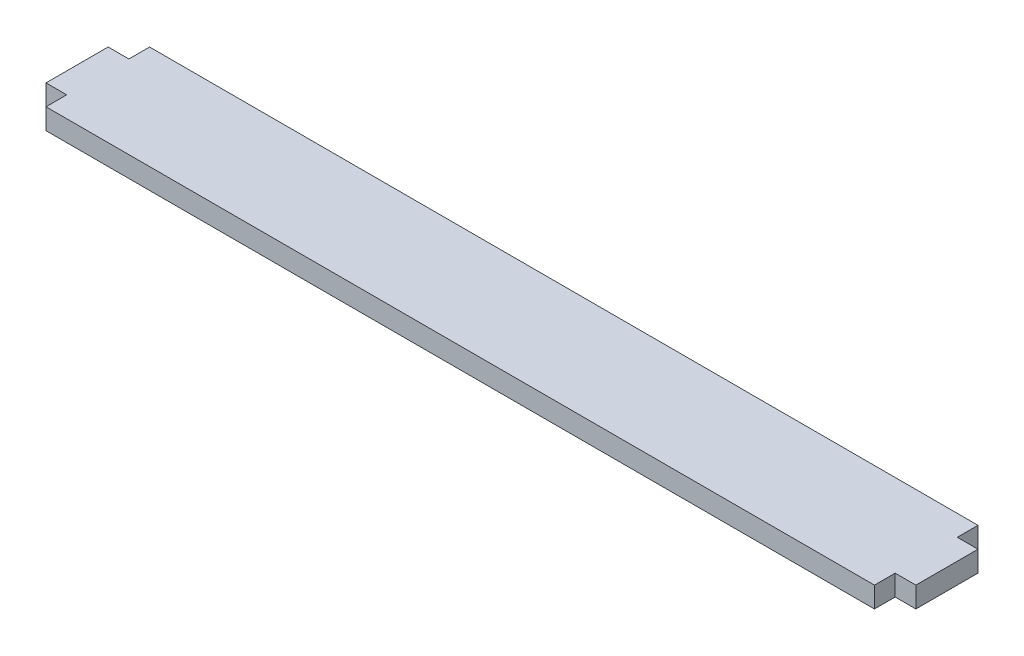
ISO-10303-21;
HEADER;
FILE_DESCRIPTION(('STEP AP214'),'2;1');
FILE_NAME('part.step','',(''),(''),'','','');
FILE_SCHEMA(('AUTOMOTIVE_DESIGN { 1 0 10303 214 1 1 1 1 }'));
ENDSEC;
DATA;
#1=APPLICATION_CONTEXT('core data for automotive mechanical design processes');
#2=APPLICATION_PROTOCOL_DEFINITION('international standard','automotive_design',2000,#1);
#3=PRODUCT_CONTEXT('',#1,'mechanical');
#4=PRODUCT('Part','Part','',(#3));
#5=PRODUCT_RELATED_PRODUCT_CATEGORY('part','',(#4));
#6=PRODUCT_DEFINITION_FORMATION('','',#4);
#7=PRODUCT_DEFINITION_CONTEXT('part definition',#1,'design');
#8=PRODUCT_DEFINITION('design','',#6,#7);
#9=PRODUCT_DEFINITION_SHAPE('','',#8);
#10=(LENGTH_UNIT() NAMED_UNIT(*) SI_UNIT(.MILLI.,.METRE.));
#11=(NAMED_UNIT(*) PLANE_ANGLE_UNIT() SI_UNIT($,.RADIAN.));
#12=(NAMED_UNIT(*) SI_UNIT($,.STERADIAN.) SOLID_ANGLE_UNIT());
#13=UNCERTAINTY_MEASURE_WITH_UNIT(LENGTH_MEASURE(1.E-05),#10,'distance_accuracy_value','');
#14=(GEOMETRIC_REPRESENTATION_CONTEXT(3) GLOBAL_UNCERTAINTY_ASSIGNED_CONTEXT((#13)) GLOBAL_UNIT_ASSIGNED_CONTEXT((#10,
#11,#12)) REPRESENTATION_CONTEXT('',''));
#15=CARTESIAN_POINT('',(0.,0.,0.));
#16=DIRECTION('',(0.,0.,1.));
#17=DIRECTION('',(1.,0.,0.));
#18=AXIS2_PLACEMENT_3D('',#15,#16,#17);
#19=CARTESIAN_POINT('',(-63.5,3.175,4.7625));
#20=DIRECTION('',(1.,0.,0.));
#21=DIRECTION('',(0.,0.,-1.));
#22=AXIS2_PLACEMENT_3D('',#19,#20,#21);
#23=PLANE('',#22);
#24=DIRECTION('',(0.,0.,1.));
#25=VECTOR('',#24,1.);
#26=CARTESIAN_POINT('',(-63.5,0.,4.7625));
#27=LINE('',#26,#25);
#28=CARTESIAN_POINT('',(-63.5,0.,4.7625));
#29=VERTEX_POINT('',#28);
#30=CARTESIAN_POINT('',(-63.5,0.,7.9375));
#31=VERTEX_POINT('',#30);
#32=EDGE_CURVE('E159',#29,#31,#27,.T.);
#33=ORIENTED_EDGE('',*,*,#32,.T.);
#34=DIRECTION('',(0.,-1.,0.));
#35=VECTOR('',#34,1.);
#36=CARTESIAN_POINT('',(-63.5,3.175,7.9375));
#37=LINE('',#36,#35);
#38=CARTESIAN_POINT('',(-63.5,3.175,7.9375));
#39=VERTEX_POINT('',#38);
#40=EDGE_CURVE('E11',#39,#31,#37,.T.);
#41=ORIENTED_EDGE('',*,*,#40,.F.);
#42=DIRECTION('',(0.,0.,1.));
#43=VECTOR('',#42,1.);
#44=CARTESIAN_POINT('',(-63.5,3.175,4.7625));
#45=LINE('',#44,#43);
#46=CARTESIAN_POINT('',(-63.5,3.175,4.7625));
#47=VERTEX_POINT('',#46);
#48=EDGE_CURVE('E181',#47,#39,#45,.T.);
#49=ORIENTED_EDGE('',*,*,#48,.F.);
#50=DIRECTION('',(0.,-1.,0.));
#51=VECTOR('',#50,1.);
#52=CARTESIAN_POINT('',(-63.5,3.175,4.7625));
#53=LINE('',#52,#51);
#54=EDGE_CURVE('E155',#47,#29,#53,.T.);
#55=ORIENTED_EDGE('',*,*,#54,.T.);
#56=EDGE_LOOP('',(#33,#41,#49,#55));
#57=FACE_BOUND('',#56,.T.);
#58=ADVANCED_FACE('F39',(#57),#23,.F.);
#59=CARTESIAN_POINT('',(-63.5,3.175,7.9375));
#60=DIRECTION('',(0.,0.,-1.));
#61=DIRECTION('',(-1.,0.,0.));
#62=AXIS2_PLACEMENT_3D('',#59,#60,#61);
#63=PLANE('',#62);
#64=DIRECTION('',(1.,0.,0.));
#65=VECTOR('',#64,1.);
#66=CARTESIAN_POINT('',(-63.5,0.,7.9375));
#67=LINE('',#66,#65);
#68=CARTESIAN_POINT('',(63.5,0.,7.9375));
#69=VERTEX_POINT('',#68);
#70=EDGE_CURVE('E162',#31,#69,#67,.T.);
#71=ORIENTED_EDGE('',*,*,#70,.T.);
#72=DIRECTION('',(0.,-1.,0.));
#73=VECTOR('',#72,1.);
#74=CARTESIAN_POINT('',(63.5,3.175,7.9375));
#75=LINE('',#74,#73);
#76=CARTESIAN_POINT('',(63.5,3.175,7.9375));
#77=VERTEX_POINT('',#76);
#78=EDGE_CURVE('E47',#77,#69,#75,.T.);
#79=ORIENTED_EDGE('',*,*,#78,.F.);
#80=DIRECTION('',(1.,0.,0.));
#81=VECTOR('',#80,1.);
#82=CARTESIAN_POINT('',(-63.5,3.175,7.9375));
#83=LINE('',#82,#81);
#84=EDGE_CURVE('E110',#39,#77,#83,.T.);
#85=ORIENTED_EDGE('',*,*,#84,.F.);
#86=ORIENTED_EDGE('',*,*,#40,.T.);
#87=EDGE_LOOP('',(#71,#79,#85,#86));
#88=FACE_BOUND('',#87,.T.);
#89=ADVANCED_FACE('F259',(#88),#63,.F.);
#90=CARTESIAN_POINT('',(63.5,3.175,7.9375));
#91=DIRECTION('',(-1.,0.,0.));
#92=DIRECTION('',(0.,0.,1.));
#93=AXIS2_PLACEMENT_3D('',#90,#91,#92);
#94=PLANE('',#93);
#95=DIRECTION('',(0.,0.,-1.));
#96=VECTOR('',#95,1.);
#97=CARTESIAN_POINT('',(63.5,0.,7.9375));
#98=LINE('',#97,#96);
#99=CARTESIAN_POINT('',(63.5,0.,4.7625));
#100=VERTEX_POINT('',#99);
#101=EDGE_CURVE('E164',#69,#100,#98,.T.);
#102=ORIENTED_EDGE('',*,*,#101,.T.);
#103=DIRECTION('',(0.,-1.,0.));
#104=VECTOR('',#103,1.);
#105=CARTESIAN_POINT('',(63.5,3.175,4.7625));
#106=LINE('',#105,#104);
#107=CARTESIAN_POINT('',(63.5,3.175,4.7625));
#108=VERTEX_POINT('',#107);
#109=EDGE_CURVE('E200',#108,#100,#106,.T.);
#110=ORIENTED_EDGE('',*,*,#109,.F.);
#111=DIRECTION('',(0.,0.,-1.));
#112=VECTOR('',#111,1.);
#113=CARTESIAN_POINT('',(63.5,3.175,7.9375));
#114=LINE('',#113,#112);
#115=EDGE_CURVE('E208',#77,#108,#114,.T.);
#116=ORIENTED_EDGE('',*,*,#115,.F.);
#117=ORIENTED_EDGE('',*,*,#78,.T.);
#118=EDGE_LOOP('',(#102,#110,#116,#117));
#119=FACE_BOUND('',#118,.T.);
#120=ADVANCED_FACE('F206',(#119),#94,.F.);
#121=CARTESIAN_POINT('',(63.5,3.175,4.7625));
#122=DIRECTION('',(0.,0.,-1.));
#123=DIRECTION('',(-1.,0.,0.));
#124=AXIS2_PLACEMENT_3D('',#121,#122,#123);
#125=PLANE('',#124);
#126=DIRECTION('',(1.,0.,0.));
#127=VECTOR('',#126,1.);
#128=CARTESIAN_POINT('',(63.5,0.,4.7625));
#129=LINE('',#128,#127);
#130=CARTESIAN_POINT('',(66.675,0.,4.7625));
#131=VERTEX_POINT('',#130);
#132=EDGE_CURVE('E166',#100,#131,#129,.T.);
#133=ORIENTED_EDGE('',*,*,#132,.T.);
#134=DIRECTION('',(0.,-1.,0.));
#135=VECTOR('',#134,1.);
#136=CARTESIAN_POINT('',(66.675,3.175,4.7625));
#137=LINE('',#136,#135);
#138=CARTESIAN_POINT('',(66.675,3.175,4.7625));
#139=VERTEX_POINT('',#138);
#140=EDGE_CURVE('E197',#139,#131,#137,.T.);
#141=ORIENTED_EDGE('',*,*,#140,.F.);
#142=DIRECTION('',(1.,0.,0.));
#143=VECTOR('',#142,1.);
#144=CARTESIAN_POINT('',(63.5,3.175,4.7625));
#145=LINE('',#144,#143);
#146=EDGE_CURVE('E226',#108,#139,#145,.T.);
#147=ORIENTED_EDGE('',*,*,#146,.F.);
#148=ORIENTED_EDGE('',*,*,#109,.T.);
#149=EDGE_LOOP('',(#133,#141,#147,#148));
#150=FACE_BOUND('',#149,.T.);
#151=ADVANCED_FACE('F217',(#150),#125,.F.);
#152=CARTESIAN_POINT('',(66.675,3.175,4.7625));
#153=DIRECTION('',(-1.,0.,0.));
#154=DIRECTION('',(0.,0.,1.));
#155=AXIS2_PLACEMENT_3D('',#152,#153,#154);
#156=PLANE('',#155);
#157=DIRECTION('',(0.,0.,-1.));
#158=VECTOR('',#157,1.);
#159=CARTESIAN_POINT('',(66.675,0.,4.7625));
#160=LINE('',#159,#158);
#161=CARTESIAN_POINT('',(66.675,0.,-4.7625));
#162=VERTEX_POINT('',#161);
#163=EDGE_CURVE('E168',#131,#162,#160,.T.);
#164=ORIENTED_EDGE('',*,*,#163,.T.);
#165=DIRECTION('',(0.,-1.,0.));
#166=VECTOR('',#165,1.);
#167=CARTESIAN_POINT('',(66.675,3.175,-4.7625));
#168=LINE('',#167,#166);
#169=CARTESIAN_POINT('',(66.675,3.175,-4.7625));
#170=VERTEX_POINT('',#169);
#171=EDGE_CURVE('E194',#170,#162,#168,.T.);
#172=ORIENTED_EDGE('',*,*,#171,.F.);
#173=DIRECTION('',(0.,0.,-1.));
#174=VECTOR('',#173,1.);
#175=CARTESIAN_POINT('',(66.675,3.175,4.7625));
#176=LINE('',#175,#174);
#177=EDGE_CURVE('E223',#139,#170,#176,.T.);
#178=ORIENTED_EDGE('',*,*,#177,.F.);
#179=ORIENTED_EDGE('',*,*,#140,.T.);
#180=EDGE_LOOP('',(#164,#172,#178,#179));
#181=FACE_BOUND('',#180,.T.);
#182=ADVANCED_FACE('F221',(#181),#156,.F.);
#183=CARTESIAN_POINT('',(66.675,3.175,-4.7625));
#184=DIRECTION('',(0.,0.,1.));
#185=DIRECTION('',(1.,0.,0.));
#186=AXIS2_PLACEMENT_3D('',#183,#184,#185);
#187=PLANE('',#186);
#188=DIRECTION('',(-1.,0.,0.));
#189=VECTOR('',#188,1.);
#190=CARTESIAN_POINT('',(66.675,0.,-4.7625));
#191=LINE('',#190,#189);
#192=CARTESIAN_POINT('',(63.5,0.,-4.7625));
#193=VERTEX_POINT('',#192);
#194=EDGE_CURVE('E170',#162,#193,#191,.T.);
#195=ORIENTED_EDGE('',*,*,#194,.T.);
#196=DIRECTION('',(0.,-1.,0.));
#197=VECTOR('',#196,1.);
#198=CARTESIAN_POINT('',(63.5,3.175,-4.7625));
#199=LINE('',#198,#197);
#200=CARTESIAN_POINT('',(63.5,3.175,-4.7625));
#201=VERTEX_POINT('',#200);
#202=EDGE_CURVE('E191',#201,#193,#199,.T.);
#203=ORIENTED_EDGE('',*,*,#202,.F.);
#204=DIRECTION('',(-1.,0.,0.));
#205=VECTOR('',#204,1.);
#206=CARTESIAN_POINT('',(66.675,3.175,-4.7625));
#207=LINE('',#206,#205);
#208=EDGE_CURVE('E225',#170,#201,#207,.T.);
#209=ORIENTED_EDGE('',*,*,#208,.F.);
#210=ORIENTED_EDGE('',*,*,#171,.T.);
#211=EDGE_LOOP('',(#195,#203,#209,#210));
#212=FACE_BOUND('',#211,.T.);
#213=ADVANCED_FACE('F272',(#212),#187,.F.);
#214=CARTESIAN_POINT('',(63.5,3.175,-4.7625));
#215=DIRECTION('',(-1.,0.,0.));
#216=DIRECTION('',(0.,0.,1.));
#217=AXIS2_PLACEMENT_3D('',#214,#215,#216);
#218=PLANE('',#217);
#219=DIRECTION('',(0.,0.,-1.));
#220=VECTOR('',#219,1.);
#221=CARTESIAN_POINT('',(63.5,0.,-4.7625));
#222=LINE('',#221,#220);
#223=CARTESIAN_POINT('',(63.5,0.,-7.9375));
#224=VERTEX_POINT('',#223);
#225=EDGE_CURVE('E172',#193,#224,#222,.T.);
#226=ORIENTED_EDGE('',*,*,#225,.T.);
#227=DIRECTION('',(0.,-1.,0.));
#228=VECTOR('',#227,1.);
#229=CARTESIAN_POINT('',(63.5,3.175,-7.9375));
#230=LINE('',#229,#228);
#231=CARTESIAN_POINT('',(63.5,3.175,-7.9375));
#232=VERTEX_POINT('',#231);
#233=EDGE_CURVE('E188',#232,#224,#230,.T.);
#234=ORIENTED_EDGE('',*,*,#233,.F.);
#235=DIRECTION('',(0.,0.,-1.));
#236=VECTOR('',#235,1.);
#237=CARTESIAN_POINT('',(63.5,3.175,-4.7625));
#238=LINE('',#237,#236);
#239=EDGE_CURVE('E228',#201,#232,#238,.T.);
#240=ORIENTED_EDGE('',*,*,#239,.F.);
#241=ORIENTED_EDGE('',*,*,#202,.T.);
#242=EDGE_LOOP('',(#226,#234,#240,#241));
#243=FACE_BOUND('',#242,.T.);
#244=ADVANCED_FACE('F275',(#243),#218,.F.);
#245=CARTESIAN_POINT('',(63.5,3.175,-7.9375));
#246=DIRECTION('',(0.,0.,1.));
#247=DIRECTION('',(1.,0.,0.));
#248=AXIS2_PLACEMENT_3D('',#245,#246,#247);
#249=PLANE('',#248);
#250=DIRECTION('',(-1.,0.,0.));
#251=VECTOR('',#250,1.);
#252=CARTESIAN_POINT('',(63.5,0.,-7.9375));
#253=LINE('',#252,#251);
#254=CARTESIAN_POINT('',(-63.5,0.,-7.9375));
#255=VERTEX_POINT('',#254);
#256=EDGE_CURVE('E174',#224,#255,#253,.T.);
#257=ORIENTED_EDGE('',*,*,#256,.T.);
#258=DIRECTION('',(0.,-1.,0.));
#259=VECTOR('',#258,1.);
#260=CARTESIAN_POINT('',(-63.5,3.175,-7.9375));
#261=LINE('',#260,#259);
#262=CARTESIAN_POINT('',(-63.5,3.175,-7.9375));
#263=VERTEX_POINT('',#262);
#264=EDGE_CURVE('E185',#263,#255,#261,.T.);
#265=ORIENTED_EDGE('',*,*,#264,.F.);
#266=DIRECTION('',(-1.,0.,0.));
#267=VECTOR('',#266,1.);
#268=CARTESIAN_POINT('',(63.5,3.175,-7.9375));
#269=LINE('',#268,#267);
#270=EDGE_CURVE('E234',#232,#263,#269,.T.);
#271=ORIENTED_EDGE('',*,*,#270,.F.);
#272=ORIENTED_EDGE('',*,*,#233,.T.);
#273=EDGE_LOOP('',(#257,#265,#271,#272));
#274=FACE_BOUND('',#273,.T.);
#275=ADVANCED_FACE('F240',(#274),#249,.F.);
#276=CARTESIAN_POINT('',(-63.5,3.175,-7.9375));
#277=DIRECTION('',(1.,0.,0.));
#278=DIRECTION('',(0.,0.,-1.));
#279=AXIS2_PLACEMENT_3D('',#276,#277,#278);
#280=PLANE('',#279);
#281=DIRECTION('',(0.,0.,1.));
#282=VECTOR('',#281,1.);
#283=CARTESIAN_POINT('',(-63.5,0.,-7.9375));
#284=LINE('',#283,#282);
#285=CARTESIAN_POINT('',(-63.5,0.,-4.7625));
#286=VERTEX_POINT('',#285);
#287=EDGE_CURVE('E176',#255,#286,#284,.T.);
#288=ORIENTED_EDGE('',*,*,#287,.T.);
#289=DIRECTION('',(0.,-1.,0.));
#290=VECTOR('',#289,1.);
#291=CARTESIAN_POINT('',(-63.5,3.175,-4.7625));
#292=LINE('',#291,#290);
#293=CARTESIAN_POINT('',(-63.5,3.175,-4.7625));
#294=VERTEX_POINT('',#293);
#295=EDGE_CURVE('E150',#294,#286,#292,.T.);
#296=ORIENTED_EDGE('',*,*,#295,.F.);
#297=DIRECTION('',(0.,0.,1.));
#298=VECTOR('',#297,1.);
#299=CARTESIAN_POINT('',(-63.5,3.175,-7.9375));
#300=LINE('',#299,#298);
#301=EDGE_CURVE('E141',#263,#294,#300,.T.);
#302=ORIENTED_EDGE('',*,*,#301,.F.);
#303=ORIENTED_EDGE('',*,*,#264,.T.);
#304=EDGE_LOOP('',(#288,#296,#302,#303));
#305=FACE_BOUND('',#304,.T.);
#306=ADVANCED_FACE('F244',(#305),#280,.F.);
#307=CARTESIAN_POINT('',(-63.5,3.175,-4.7625));
#308=DIRECTION('',(0.,0.,1.));
#309=DIRECTION('',(1.,0.,0.));
#310=AXIS2_PLACEMENT_3D('',#307,#308,#309);
#311=PLANE('',#310);
#312=DIRECTION('',(-1.,0.,0.));
#313=VECTOR('',#312,1.);
#314=CARTESIAN_POINT('',(-63.5,0.,-4.7625));
#315=LINE('',#314,#313);
#316=CARTESIAN_POINT('',(-66.675,0.,-4.7625));
#317=VERTEX_POINT('',#316);
#318=EDGE_CURVE('E149',#286,#317,#315,.T.);
#319=ORIENTED_EDGE('',*,*,#318,.T.);
#320=DIRECTION('',(0.,-1.,0.));
#321=VECTOR('',#320,1.);
#322=CARTESIAN_POINT('',(-66.675,3.175,-4.7625));
#323=LINE('',#322,#321);
#324=CARTESIAN_POINT('',(-66.675,3.175,-4.7625));
#325=VERTEX_POINT('',#324);
#326=EDGE_CURVE('E146',#325,#317,#323,.T.);
#327=ORIENTED_EDGE('',*,*,#326,.F.);
#328=DIRECTION('',(-1.,0.,0.));
#329=VECTOR('',#328,1.);
#330=CARTESIAN_POINT('',(-63.5,3.175,-4.7625));
#331=LINE('',#330,#329);
#332=EDGE_CURVE('E135',#294,#325,#331,.T.);
#333=ORIENTED_EDGE('',*,*,#332,.F.);
#334=ORIENTED_EDGE('',*,*,#295,.T.);
#335=EDGE_LOOP('',(#319,#327,#333,#334));
#336=FACE_BOUND('',#335,.T.);
#337=ADVANCED_FACE('F147',(#336),#311,.F.);
#338=CARTESIAN_POINT('',(-66.675,3.175,-4.7625));
#339=DIRECTION('',(1.,0.,0.));
#340=DIRECTION('',(0.,0.,-1.));
#341=AXIS2_PLACEMENT_3D('',#338,#339,#340);
#342=PLANE('',#341);
#343=DIRECTION('',(0.,0.,1.));
#344=VECTOR('',#343,1.);
#345=CARTESIAN_POINT('',(-66.675,0.,-4.7625));
#346=LINE('',#345,#344);
#347=CARTESIAN_POINT('',(-66.675,0.,4.7625));
#348=VERTEX_POINT('',#347);
#349=EDGE_CURVE('E96',#317,#348,#346,.T.);
#350=ORIENTED_EDGE('',*,*,#349,.T.);
#351=DIRECTION('',(0.,-1.,0.));
#352=VECTOR('',#351,1.);
#353=CARTESIAN_POINT('',(-66.675,3.175,4.7625));
#354=LINE('',#353,#352);
#355=CARTESIAN_POINT('',(-66.675,3.175,4.7625));
#356=VERTEX_POINT('',#355);
#357=EDGE_CURVE('E151',#356,#348,#354,.T.);
#358=ORIENTED_EDGE('',*,*,#357,.F.);
#359=DIRECTION('',(0.,0.,1.));
#360=VECTOR('',#359,1.);
#361=CARTESIAN_POINT('',(-66.675,3.175,-4.7625));
#362=LINE('',#361,#360);
#363=EDGE_CURVE('E139',#325,#356,#362,.T.);
#364=ORIENTED_EDGE('',*,*,#363,.F.);
#365=ORIENTED_EDGE('',*,*,#326,.T.);
#366=EDGE_LOOP('',(#350,#358,#364,#365));
#367=FACE_BOUND('',#366,.T.);
#368=ADVANCED_FACE('F153',(#367),#342,.F.);
#369=CARTESIAN_POINT('',(-66.675,3.175,4.7625));
#370=DIRECTION('',(0.,0.,-1.));
#371=DIRECTION('',(-1.,0.,0.));
#372=AXIS2_PLACEMENT_3D('',#369,#370,#371);
#373=PLANE('',#372);
#374=DIRECTION('',(1.,0.,0.));
#375=VECTOR('',#374,1.);
#376=CARTESIAN_POINT('',(-66.675,0.,4.7625));
#377=LINE('',#376,#375);
#378=EDGE_CURVE('E102',#348,#29,#377,.T.);
#379=ORIENTED_EDGE('',*,*,#378,.T.);
#380=ORIENTED_EDGE('',*,*,#54,.F.);
#381=DIRECTION('',(1.,0.,0.));
#382=VECTOR('',#381,1.);
#383=CARTESIAN_POINT('',(-66.675,3.175,4.7625));
#384=LINE('',#383,#382);
#385=EDGE_CURVE('E55',#356,#47,#384,.T.);
#386=ORIENTED_EDGE('',*,*,#385,.F.);
#387=ORIENTED_EDGE('',*,*,#357,.T.);
#388=EDGE_LOOP('',(#379,#380,#386,#387));
#389=FACE_BOUND('',#388,.T.);
#390=ADVANCED_FACE('F248',(#389),#373,.F.);
#391=CARTESIAN_POINT('',(0.,3.175,0.));
#392=DIRECTION('',(0.,1.,0.));
#393=DIRECTION('',(0.,0.,1.));
#394=AXIS2_PLACEMENT_3D('',#391,#392,#393);
#395=PLANE('',#394);
#396=ORIENTED_EDGE('',*,*,#48,.T.);
#397=ORIENTED_EDGE('',*,*,#84,.T.);
#398=ORIENTED_EDGE('',*,*,#115,.T.);
#399=ORIENTED_EDGE('',*,*,#146,.T.);
#400=ORIENTED_EDGE('',*,*,#177,.T.);
#401=ORIENTED_EDGE('',*,*,#208,.T.);
#402=ORIENTED_EDGE('',*,*,#239,.T.);
#403=ORIENTED_EDGE('',*,*,#270,.T.);
#404=ORIENTED_EDGE('',*,*,#301,.T.);
#405=ORIENTED_EDGE('',*,*,#332,.T.);
#406=ORIENTED_EDGE('',*,*,#363,.T.);
#407=ORIENTED_EDGE('',*,*,#385,.T.);
#408=EDGE_LOOP('',(#396,#397,#398,#399,#400,#401,#402,#403,#404,#405,#406,#407));
#409=FACE_BOUND('',#408,.T.);
#410=ADVANCED_FACE('F137',(#409),#395,.T.);
#411=CARTESIAN_POINT('',(0.,0.,0.));
#412=DIRECTION('',(0.,1.,0.));
#413=DIRECTION('',(0.,0.,1.));
#414=AXIS2_PLACEMENT_3D('',#411,#412,#413);
#415=PLANE('',#414);
#416=ORIENTED_EDGE('',*,*,#32,.F.);
#417=ORIENTED_EDGE('',*,*,#378,.F.);
#418=ORIENTED_EDGE('',*,*,#349,.F.);
#419=ORIENTED_EDGE('',*,*,#318,.F.);
#420=ORIENTED_EDGE('',*,*,#287,.F.);
#421=ORIENTED_EDGE('',*,*,#256,.F.);
#422=ORIENTED_EDGE('',*,*,#225,.F.);
#423=ORIENTED_EDGE('',*,*,#194,.F.);
#424=ORIENTED_EDGE('',*,*,#163,.F.);
#425=ORIENTED_EDGE('',*,*,#132,.F.);
#426=ORIENTED_EDGE('',*,*,#101,.F.);
#427=ORIENTED_EDGE('',*,*,#70,.F.);
#428=EDGE_LOOP('',(#416,#417,#418,#419,#420,#421,#422,#423,#424,#425,#426,#427));
#429=FACE_BOUND('',#428,.T.);
#430=ADVANCED_FACE('F212',(#429),#415,.F.);
#431=CLOSED_SHELL('',(#58,#89,#120,#151,#182,#213,#244,#275,#306,#337,#368,#390,#410,#430));
#432=MANIFOLD_SOLID_BREP('B2',#431);
#433=ADVANCED_BREP_SHAPE_REPRESENTATION('',(#18,#432),#14);
#434=SHAPE_DEFINITION_REPRESENTATION(#9,#433);
ENDSEC;
END-ISO-10303-21;
